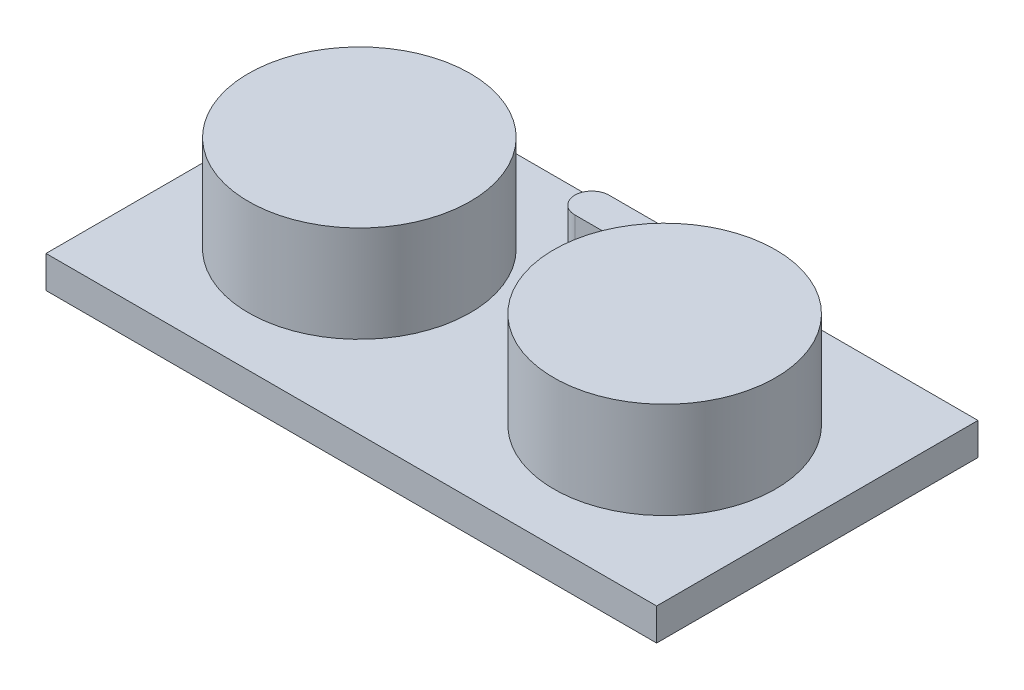
ISO-10303-21;
HEADER;
FILE_DESCRIPTION(('STEP AP214'),'2;1');
FILE_NAME('part.step','',(''),(''),'','','');
FILE_SCHEMA(('AUTOMOTIVE_DESIGN { 1 0 10303 214 1 1 1 1 }'));
ENDSEC;
DATA;
#1=APPLICATION_CONTEXT('core data for automotive mechanical design processes');
#2=APPLICATION_PROTOCOL_DEFINITION('international standard','automotive_design',2000,#1);
#3=PRODUCT_CONTEXT('',#1,'mechanical');
#4=PRODUCT('Part','Part','',(#3));
#5=PRODUCT_RELATED_PRODUCT_CATEGORY('part','',(#4));
#6=PRODUCT_DEFINITION_FORMATION('','',#4);
#7=PRODUCT_DEFINITION_CONTEXT('part definition',#1,'design');
#8=PRODUCT_DEFINITION('design','',#6,#7);
#9=PRODUCT_DEFINITION_SHAPE('','',#8);
#10=(LENGTH_UNIT() NAMED_UNIT(*) SI_UNIT(.MILLI.,.METRE.));
#11=(NAMED_UNIT(*) PLANE_ANGLE_UNIT() SI_UNIT($,.RADIAN.));
#12=(NAMED_UNIT(*) SI_UNIT($,.STERADIAN.) SOLID_ANGLE_UNIT());
#13=UNCERTAINTY_MEASURE_WITH_UNIT(LENGTH_MEASURE(1.E-05),#10,'distance_accuracy_value','');
#14=(GEOMETRIC_REPRESENTATION_CONTEXT(3) GLOBAL_UNCERTAINTY_ASSIGNED_CONTEXT((#13)) GLOBAL_UNIT_ASSIGNED_CONTEXT((#10,
#11,#12)) REPRESENTATION_CONTEXT('',''));
#15=CARTESIAN_POINT('',(0.,0.,0.));
#16=DIRECTION('',(0.,0.,1.));
#17=DIRECTION('',(1.,0.,0.));
#18=AXIS2_PLACEMENT_3D('',#15,#16,#17);
#19=CARTESIAN_POINT('',(-30.4443925233645,2.54,0.));
#20=DIRECTION('',(1.,0.,0.));
#21=DIRECTION('',(0.,0.,-1.));
#22=AXIS2_PLACEMENT_3D('',#19,#20,#21);
#23=PLANE('',#22);
#24=DIRECTION('',(0.,0.,1.));
#25=VECTOR('',#24,1.);
#26=CARTESIAN_POINT('',(-30.4443925233645,0.,0.));
#27=LINE('',#26,#25);
#28=CARTESIAN_POINT('',(-30.4443925233645,0.,-5.16011682242991));
#29=VERTEX_POINT('',#28);
#30=CARTESIAN_POINT('',(-30.4443925233645,0.,20.2398831775701));
#31=VERTEX_POINT('',#30);
#32=EDGE_CURVE('E176',#29,#31,#27,.T.);
#33=ORIENTED_EDGE('',*,*,#32,.T.);
#34=DIRECTION('',(0.,-1.,0.));
#35=VECTOR('',#34,1.);
#36=CARTESIAN_POINT('',(-30.4443925233645,2.54,20.2398831775701));
#37=LINE('',#36,#35);
#38=CARTESIAN_POINT('',(-30.4443925233645,2.54,20.2398831775701));
#39=VERTEX_POINT('',#38);
#40=EDGE_CURVE('E53',#39,#31,#37,.T.);
#41=ORIENTED_EDGE('',*,*,#40,.F.);
#42=DIRECTION('',(0.,0.,1.));
#43=VECTOR('',#42,1.);
#44=CARTESIAN_POINT('',(-30.4443925233645,2.54,0.));
#45=LINE('',#44,#43);
#46=CARTESIAN_POINT('',(-30.4443925233645,2.54,-5.16011682242991));
#47=VERTEX_POINT('',#46);
#48=EDGE_CURVE('E177',#47,#39,#45,.T.);
#49=ORIENTED_EDGE('',*,*,#48,.F.);
#50=DIRECTION('',(0.,-1.,0.));
#51=VECTOR('',#50,1.);
#52=CARTESIAN_POINT('',(-30.4443925233645,2.54,-5.16011682242991));
#53=LINE('',#52,#51);
#54=EDGE_CURVE('E69',#47,#29,#53,.T.);
#55=ORIENTED_EDGE('',*,*,#54,.T.);
#56=EDGE_LOOP('',(#33,#41,#49,#55));
#57=FACE_BOUND('',#56,.T.);
#58=ADVANCED_FACE('F45',(#57),#23,.F.);
#59=CARTESIAN_POINT('',(0.,2.54,20.2398831775701));
#60=DIRECTION('',(0.,0.,-1.));
#61=DIRECTION('',(-1.,0.,0.));
#62=AXIS2_PLACEMENT_3D('',#59,#60,#61);
#63=PLANE('',#62);
#64=DIRECTION('',(1.,0.,0.));
#65=VECTOR('',#64,1.);
#66=CARTESIAN_POINT('',(0.,0.,20.2398831775701));
#67=LINE('',#66,#65);
#68=CARTESIAN_POINT('',(17.8156074766355,0.,20.2398831775701));
#69=VERTEX_POINT('',#68);
#70=EDGE_CURVE('E192',#31,#69,#67,.T.);
#71=ORIENTED_EDGE('',*,*,#70,.T.);
#72=DIRECTION('',(0.,-1.,0.));
#73=VECTOR('',#72,1.);
#74=CARTESIAN_POINT('',(17.8156074766355,2.54,20.2398831775701));
#75=LINE('',#74,#73);
#76=CARTESIAN_POINT('',(17.8156074766355,2.54,20.2398831775701));
#77=VERTEX_POINT('',#76);
#78=EDGE_CURVE('E208',#77,#69,#75,.T.);
#79=ORIENTED_EDGE('',*,*,#78,.F.);
#80=DIRECTION('',(1.,0.,0.));
#81=VECTOR('',#80,1.);
#82=CARTESIAN_POINT('',(0.,2.54,20.2398831775701));
#83=LINE('',#82,#81);
#84=EDGE_CURVE('E96',#39,#77,#83,.T.);
#85=ORIENTED_EDGE('',*,*,#84,.F.);
#86=ORIENTED_EDGE('',*,*,#40,.T.);
#87=EDGE_LOOP('',(#71,#79,#85,#86));
#88=FACE_BOUND('',#87,.T.);
#89=ADVANCED_FACE('F212',(#88),#63,.F.);
#90=CARTESIAN_POINT('',(17.8156074766355,2.54,0.));
#91=DIRECTION('',(1.,0.,0.));
#92=DIRECTION('',(0.,0.,-1.));
#93=AXIS2_PLACEMENT_3D('',#90,#91,#92);
#94=PLANE('',#93);
#95=DIRECTION('',(0.,0.,1.));
#96=VECTOR('',#95,1.);
#97=CARTESIAN_POINT('',(17.8156074766355,0.,0.));
#98=LINE('',#97,#96);
#99=CARTESIAN_POINT('',(17.8156074766355,0.,-5.16011682242991));
#100=VERTEX_POINT('',#99);
#101=EDGE_CURVE('E196',#100,#69,#98,.T.);
#102=ORIENTED_EDGE('',*,*,#101,.F.);
#103=DIRECTION('',(0.,-1.,0.));
#104=VECTOR('',#103,1.);
#105=CARTESIAN_POINT('',(17.8156074766355,2.54,-5.16011682242991));
#106=LINE('',#105,#104);
#107=CARTESIAN_POINT('',(17.8156074766355,2.54,-5.16011682242991));
#108=VERTEX_POINT('',#107);
#109=EDGE_CURVE('E205',#108,#100,#106,.T.);
#110=ORIENTED_EDGE('',*,*,#109,.F.);
#111=DIRECTION('',(0.,0.,1.));
#112=VECTOR('',#111,1.);
#113=CARTESIAN_POINT('',(17.8156074766355,2.54,0.));
#114=LINE('',#113,#112);
#115=EDGE_CURVE('E183',#108,#77,#114,.T.);
#116=ORIENTED_EDGE('',*,*,#115,.T.);
#117=ORIENTED_EDGE('',*,*,#78,.T.);
#118=EDGE_LOOP('',(#102,#110,#116,#117));
#119=FACE_BOUND('',#118,.T.);
#120=ADVANCED_FACE('F220',(#119),#94,.T.);
#121=CARTESIAN_POINT('',(0.,2.54,-5.16011682242991));
#122=DIRECTION('',(0.,0.,-1.));
#123=DIRECTION('',(-1.,0.,0.));
#124=AXIS2_PLACEMENT_3D('',#121,#122,#123);
#125=PLANE('',#124);
#126=DIRECTION('',(1.,0.,0.));
#127=VECTOR('',#126,1.);
#128=CARTESIAN_POINT('',(0.,0.,-5.16011682242991));
#129=LINE('',#128,#127);
#130=EDGE_CURVE('E180',#29,#100,#129,.T.);
#131=ORIENTED_EDGE('',*,*,#130,.F.);
#132=ORIENTED_EDGE('',*,*,#54,.F.);
#133=DIRECTION('',(1.,0.,0.));
#134=VECTOR('',#133,1.);
#135=CARTESIAN_POINT('',(0.,2.54,-5.16011682242991));
#136=LINE('',#135,#134);
#137=EDGE_CURVE('E187',#47,#108,#136,.T.);
#138=ORIENTED_EDGE('',*,*,#137,.T.);
#139=ORIENTED_EDGE('',*,*,#109,.T.);
#140=EDGE_LOOP('',(#131,#132,#138,#139));
#141=FACE_BOUND('',#140,.T.);
#142=ADVANCED_FACE('F215',(#141),#125,.T.);
#143=CARTESIAN_POINT('',(0.,2.54,0.));
#144=DIRECTION('',(0.,1.,0.));
#145=DIRECTION('',(0.,0.,1.));
#146=AXIS2_PLACEMENT_3D('',#143,#144,#145);
#147=PLANE('',#146);
#148=CARTESIAN_POINT('',(-9.64277486318207,2.54,-2.10722501049491));
#149=DIRECTION('',(0.,1.,0.));
#150=DIRECTION('',(0.,0.,1.));
#151=AXIS2_PLACEMENT_3D('',#148,#149,#150);
#152=CIRCLE('',#151,1.35215532555089);
#153=CARTESIAN_POINT('',(-9.64277486318207,2.54,-0.755069684944015));
#154=VERTEX_POINT('',#153);
#155=CARTESIAN_POINT('',(-9.64277486318207,2.54,-3.4593803360458));
#156=VERTEX_POINT('',#155);
#157=EDGE_CURVE('E159',#154,#156,#152,.F.);
#158=ORIENTED_EDGE('',*,*,#157,.T.);
#159=DIRECTION('',(1.,0.,0.));
#160=VECTOR('',#159,1.);
#161=CARTESIAN_POINT('',(0.,2.54,-3.4593803360458));
#162=LINE('',#161,#160);
#163=CARTESIAN_POINT('',(-2.56996239106971,2.54,-3.4593803360458));
#164=VERTEX_POINT('',#163);
#165=EDGE_CURVE('E144',#156,#164,#162,.T.);
#166=ORIENTED_EDGE('',*,*,#165,.T.);
#167=CARTESIAN_POINT('',(-2.56996239106971,2.54,-2.10722501049491));
#168=DIRECTION('',(0.,1.,0.));
#169=DIRECTION('',(0.,0.,1.));
#170=AXIS2_PLACEMENT_3D('',#167,#168,#169);
#171=CIRCLE('',#170,1.35215532555089);
#172=CARTESIAN_POINT('',(-2.56996239106971,2.54,-0.755069684944015));
#173=VERTEX_POINT('',#172);
#174=EDGE_CURVE('E146',#164,#173,#171,.F.);
#175=ORIENTED_EDGE('',*,*,#174,.T.);
#176=DIRECTION('',(-1.,0.,0.));
#177=VECTOR('',#176,1.);
#178=CARTESIAN_POINT('',(0.,2.54,-0.755069684944015));
#179=LINE('',#178,#177);
#180=EDGE_CURVE('E151',#173,#154,#179,.T.);
#181=ORIENTED_EDGE('',*,*,#180,.T.);
#182=EDGE_LOOP('',(#158,#166,#175,#181));
#183=FACE_BOUND('',#182,.T.);
#184=CARTESIAN_POINT('',(5.7506074766355,2.54,7.53988317757009));
#185=DIRECTION('',(0.,1.,0.));
#186=DIRECTION('',(0.,0.,1.));
#187=AXIS2_PLACEMENT_3D('',#184,#185,#186);
#188=CIRCLE('',#187,8.76516143286362);
#189=CARTESIAN_POINT('',(5.7506074766355,2.54,-1.22527825529352));
#190=VERTEX_POINT('',#189);
#191=EDGE_CURVE('E165',#190,#190,#188,.T.);
#192=ORIENTED_EDGE('',*,*,#191,.F.);
#193=EDGE_LOOP('',(#192));
#194=FACE_BOUND('',#193,.T.);
#195=CARTESIAN_POINT('',(-18.3793925233645,2.54,7.53988317757009));
#196=DIRECTION('',(0.,1.,0.));
#197=DIRECTION('',(0.,0.,1.));
#198=AXIS2_PLACEMENT_3D('',#195,#196,#197);
#199=CIRCLE('',#198,8.76516143286362);
#200=CARTESIAN_POINT('',(-18.3793925233645,2.54,-1.22527825529352));
#201=VERTEX_POINT('',#200);
#202=EDGE_CURVE('E11',#201,#201,#199,.T.);
#203=ORIENTED_EDGE('',*,*,#202,.F.);
#204=EDGE_LOOP('',(#203));
#205=FACE_BOUND('',#204,.T.);
#206=ORIENTED_EDGE('',*,*,#48,.T.);
#207=ORIENTED_EDGE('',*,*,#84,.T.);
#208=ORIENTED_EDGE('',*,*,#115,.F.);
#209=ORIENTED_EDGE('',*,*,#137,.F.);
#210=EDGE_LOOP('',(#206,#207,#208,#209));
#211=FACE_BOUND('',#210,.T.);
#212=ADVANCED_FACE('F222',(#183,#194,#205,#211),#147,.T.);
#213=CARTESIAN_POINT('',(0.,0.,0.));
#214=DIRECTION('',(0.,1.,0.));
#215=DIRECTION('',(0.,0.,1.));
#216=AXIS2_PLACEMENT_3D('',#213,#214,#215);
#217=PLANE('',#216);
#218=ORIENTED_EDGE('',*,*,#32,.F.);
#219=ORIENTED_EDGE('',*,*,#130,.T.);
#220=ORIENTED_EDGE('',*,*,#101,.T.);
#221=ORIENTED_EDGE('',*,*,#70,.F.);
#222=EDGE_LOOP('',(#218,#219,#220,#221));
#223=FACE_BOUND('',#222,.T.);
#224=ADVANCED_FACE('F214',(#223),#217,.F.);
#225=CARTESIAN_POINT('',(-18.3793925233645,10.16,7.53988317757009));
#226=DIRECTION('',(0.,-1.,0.));
#227=DIRECTION('',(0.,0.,-1.));
#228=AXIS2_PLACEMENT_3D('',#225,#226,#227);
#229=CYLINDRICAL_SURFACE('',#228,8.76516143286362);
#230=CARTESIAN_POINT('',(-18.3793925233645,10.16,7.53988317757009));
#231=DIRECTION('',(0.,-1.,0.));
#232=DIRECTION('',(0.,0.,-1.));
#233=AXIS2_PLACEMENT_3D('',#230,#231,#232);
#234=CIRCLE('',#233,8.76516143286362);
#235=CARTESIAN_POINT('',(-18.3793925233645,10.16,-1.22527825529352));
#236=VERTEX_POINT('',#235);
#237=EDGE_CURVE('E169',#236,#236,#234,.T.);
#238=CARTESIAN_POINT('',(-18.3793925233645,10.16,-1.22527825529352));
#239=CARTESIAN_POINT('',(-18.3793925233645,10.080625,-1.22527825529352));
#240=CARTESIAN_POINT('',(-18.3793925233645,10.00125,-1.22527825529352));
#241=CARTESIAN_POINT('',(-18.3793925233645,9.8425,-1.22527825529352));
#242=CARTESIAN_POINT('',(-18.3793925233645,9.763125,-1.22527825529352));
#243=CARTESIAN_POINT('',(-18.3793925233645,9.604375,-1.22527825529352));
#244=CARTESIAN_POINT('',(-18.3793925233645,9.525,-1.22527825529352));
#245=CARTESIAN_POINT('',(-18.3793925233645,9.36625,-1.22527825529352));
#246=CARTESIAN_POINT('',(-18.3793925233645,9.286875,-1.22527825529352));
#247=CARTESIAN_POINT('',(-18.3793925233645,9.128125,-1.22527825529352));
#248=CARTESIAN_POINT('',(-18.3793925233645,9.04875,-1.22527825529352));
#249=CARTESIAN_POINT('',(-18.3793925233645,8.89,-1.22527825529352));
#250=CARTESIAN_POINT('',(-18.3793925233645,8.810625,-1.22527825529352));
#251=CARTESIAN_POINT('',(-18.3793925233645,8.651875,-1.22527825529352));
#252=CARTESIAN_POINT('',(-18.3793925233645,8.5725,-1.22527825529352));
#253=CARTESIAN_POINT('',(-18.3793925233645,8.41375,-1.22527825529352));
#254=CARTESIAN_POINT('',(-18.3793925233645,8.334375,-1.22527825529352));
#255=CARTESIAN_POINT('',(-18.3793925233645,8.175625,-1.22527825529352));
#256=CARTESIAN_POINT('',(-18.3793925233645,8.09625,-1.22527825529352));
#257=CARTESIAN_POINT('',(-18.3793925233645,7.9375,-1.22527825529352));
#258=CARTESIAN_POINT('',(-18.3793925233645,7.858125,-1.22527825529352));
#259=CARTESIAN_POINT('',(-18.3793925233645,7.699375,-1.22527825529352));
#260=CARTESIAN_POINT('',(-18.3793925233645,7.62,-1.22527825529352));
#261=CARTESIAN_POINT('',(-18.3793925233645,7.46125,-1.22527825529352));
#262=CARTESIAN_POINT('',(-18.3793925233645,7.381875,-1.22527825529352));
#263=CARTESIAN_POINT('',(-18.3793925233645,7.223125,-1.22527825529352));
#264=CARTESIAN_POINT('',(-18.3793925233645,7.14375,-1.22527825529352));
#265=CARTESIAN_POINT('',(-18.3793925233645,6.985,-1.22527825529352));
#266=CARTESIAN_POINT('',(-18.3793925233645,6.905625,-1.22527825529352));
#267=CARTESIAN_POINT('',(-18.3793925233645,6.746875,-1.22527825529352));
#268=CARTESIAN_POINT('',(-18.3793925233645,6.6675,-1.22527825529352));
#269=CARTESIAN_POINT('',(-18.3793925233645,6.50875,-1.22527825529352));
#270=CARTESIAN_POINT('',(-18.3793925233645,6.429375,-1.22527825529352));
#271=CARTESIAN_POINT('',(-18.3793925233645,6.270625,-1.22527825529352));
#272=CARTESIAN_POINT('',(-18.3793925233645,6.19125,-1.22527825529352));
#273=CARTESIAN_POINT('',(-18.3793925233645,6.0325,-1.22527825529352));
#274=CARTESIAN_POINT('',(-18.3793925233645,5.953125,-1.22527825529352));
#275=CARTESIAN_POINT('',(-18.3793925233645,5.794375,-1.22527825529352));
#276=CARTESIAN_POINT('',(-18.3793925233645,5.715,-1.22527825529352));
#277=CARTESIAN_POINT('',(-18.3793925233645,5.55625,-1.22527825529352));
#278=CARTESIAN_POINT('',(-18.3793925233645,5.476875,-1.22527825529352));
#279=CARTESIAN_POINT('',(-18.3793925233645,5.318125,-1.22527825529352));
#280=CARTESIAN_POINT('',(-18.3793925233645,5.23875,-1.22527825529352));
#281=CARTESIAN_POINT('',(-18.3793925233645,5.08,-1.22527825529352));
#282=CARTESIAN_POINT('',(-18.3793925233645,5.000625,-1.22527825529352));
#283=CARTESIAN_POINT('',(-18.3793925233645,4.841875,-1.22527825529352));
#284=CARTESIAN_POINT('',(-18.3793925233645,4.7625,-1.22527825529352));
#285=CARTESIAN_POINT('',(-18.3793925233645,4.60375,-1.22527825529352));
#286=CARTESIAN_POINT('',(-18.3793925233645,4.524375,-1.22527825529352));
#287=CARTESIAN_POINT('',(-18.3793925233645,4.365625,-1.22527825529352));
#288=CARTESIAN_POINT('',(-18.3793925233645,4.28625,-1.22527825529352));
#289=CARTESIAN_POINT('',(-18.3793925233645,4.1275,-1.22527825529352));
#290=CARTESIAN_POINT('',(-18.3793925233645,4.048125,-1.22527825529352));
#291=CARTESIAN_POINT('',(-18.3793925233645,3.889375,-1.22527825529352));
#292=CARTESIAN_POINT('',(-18.3793925233645,3.81,-1.22527825529352));
#293=CARTESIAN_POINT('',(-18.3793925233645,3.65125,-1.22527825529352));
#294=CARTESIAN_POINT('',(-18.3793925233645,3.571875,-1.22527825529352));
#295=CARTESIAN_POINT('',(-18.3793925233645,3.413125,-1.22527825529352));
#296=CARTESIAN_POINT('',(-18.3793925233645,3.33375,-1.22527825529352));
#297=CARTESIAN_POINT('',(-18.3793925233645,3.175,-1.22527825529352));
#298=CARTESIAN_POINT('',(-18.3793925233645,3.095625,-1.22527825529352));
#299=CARTESIAN_POINT('',(-18.3793925233645,2.936875,-1.22527825529352));
#300=CARTESIAN_POINT('',(-18.3793925233645,2.8575,-1.22527825529352));
#301=CARTESIAN_POINT('',(-18.3793925233645,2.69875,-1.22527825529352));
#302=CARTESIAN_POINT('',(-18.3793925233645,2.619375,-1.22527825529352));
#303=CARTESIAN_POINT('',(-18.3793925233645,2.54,-1.22527825529352));
#304=B_SPLINE_CURVE_WITH_KNOTS('',3,(#238,#239,#240,#241,#242,#243,#244,#245,#246,#247,#248,
#249,#250,#251,#252,#253,#254,#255,#256,#257,#258,#259,#260,#261,#262,#263,#264,#265,#266,#267,
#268,#269,#270,#271,#272,#273,#274,#275,#276,#277,#278,#279,#280,#281,#282,#283,#284,#285,#286,
#287,#288,#289,#290,#291,#292,#293,#294,#295,#296,#297,#298,#299,#300,#301,#302,#303),
.UNSPECIFIED.,.F.,.F.,(4,2,2,2,2,2,2,2,2,2,2,2,2,2,2,2,2,2,2,2,2,2,2,2,2,2,2,2,2,2,2,2,4),(0.,
0.238125,0.476250000000001,0.714375000000001,0.9525,1.190625,1.42875,1.666875,1.905,2.143125,
2.38125,2.619375,2.8575,3.095625,3.33375,3.571875,3.81,4.048125,4.28625,4.524375,4.7625,
5.000625,5.23875,5.476875,5.715,5.953125,6.19125,6.429375,6.6675,6.905625,7.14375,7.381875,
7.62),.UNSPECIFIED.);
#305=EDGE_CURVE('BSEAM230',#236,#201,#304,.T.);
#306=ORIENTED_EDGE('',*,*,#237,.T.);
#307=ORIENTED_EDGE('',*,*,#202,.T.);
#308=ORIENTED_EDGE('',*,*,#305,.T.);
#309=ORIENTED_EDGE('',*,*,#305,.F.);
#310=EDGE_LOOP('',(#306,#308,#307,#309));
#311=FACE_BOUND('',#310,.T.);
#312=ADVANCED_FACE('F230',(#311),#229,.T.);
#313=CARTESIAN_POINT('',(-18.3793925233645,10.16,7.53988317757009));
#314=DIRECTION('',(0.,-1.,0.));
#315=DIRECTION('',(0.,0.,-1.));
#316=AXIS2_PLACEMENT_3D('',#313,#314,#315);
#317=PLANE('',#316);
#318=ORIENTED_EDGE('',*,*,#237,.F.);
#319=EDGE_LOOP('',(#318));
#320=FACE_BOUND('',#319,.T.);
#321=ADVANCED_FACE('F265',(#320),#317,.F.);
#322=CARTESIAN_POINT('',(5.7506074766355,10.16,7.53988317757009));
#323=DIRECTION('',(0.,-1.,0.));
#324=DIRECTION('',(0.,0.,-1.));
#325=AXIS2_PLACEMENT_3D('',#322,#323,#324);
#326=CYLINDRICAL_SURFACE('',#325,8.76516143286362);
#327=CARTESIAN_POINT('',(5.7506074766355,10.16,7.53988317757009));
#328=DIRECTION('',(0.,1.,0.));
#329=DIRECTION('',(0.,0.,1.));
#330=AXIS2_PLACEMENT_3D('',#327,#328,#329);
#331=CIRCLE('',#330,8.76516143286362);
#332=CARTESIAN_POINT('',(5.7506074766355,10.16,-1.22527825529352));
#333=VERTEX_POINT('',#332);
#334=EDGE_CURVE('E164',#333,#333,#331,.T.);
#335=CARTESIAN_POINT('',(5.7506074766355,10.16,-1.22527825529352));
#336=CARTESIAN_POINT('',(5.7506074766355,10.080625,-1.22527825529352));
#337=CARTESIAN_POINT('',(5.7506074766355,10.00125,-1.22527825529352));
#338=CARTESIAN_POINT('',(5.7506074766355,9.8425,-1.22527825529352));
#339=CARTESIAN_POINT('',(5.7506074766355,9.763125,-1.22527825529352));
#340=CARTESIAN_POINT('',(5.7506074766355,9.604375,-1.22527825529352));
#341=CARTESIAN_POINT('',(5.7506074766355,9.525,-1.22527825529352));
#342=CARTESIAN_POINT('',(5.7506074766355,9.36625,-1.22527825529352));
#343=CARTESIAN_POINT('',(5.7506074766355,9.286875,-1.22527825529352));
#344=CARTESIAN_POINT('',(5.7506074766355,9.128125,-1.22527825529352));
#345=CARTESIAN_POINT('',(5.7506074766355,9.04875,-1.22527825529352));
#346=CARTESIAN_POINT('',(5.7506074766355,8.89,-1.22527825529352));
#347=CARTESIAN_POINT('',(5.7506074766355,8.810625,-1.22527825529352));
#348=CARTESIAN_POINT('',(5.7506074766355,8.651875,-1.22527825529352));
#349=CARTESIAN_POINT('',(5.7506074766355,8.5725,-1.22527825529352));
#350=CARTESIAN_POINT('',(5.7506074766355,8.41375,-1.22527825529352));
#351=CARTESIAN_POINT('',(5.7506074766355,8.334375,-1.22527825529352));
#352=CARTESIAN_POINT('',(5.7506074766355,8.175625,-1.22527825529352));
#353=CARTESIAN_POINT('',(5.7506074766355,8.09625,-1.22527825529352));
#354=CARTESIAN_POINT('',(5.7506074766355,7.9375,-1.22527825529352));
#355=CARTESIAN_POINT('',(5.7506074766355,7.858125,-1.22527825529352));
#356=CARTESIAN_POINT('',(5.7506074766355,7.699375,-1.22527825529352));
#357=CARTESIAN_POINT('',(5.7506074766355,7.62,-1.22527825529352));
#358=CARTESIAN_POINT('',(5.7506074766355,7.46125,-1.22527825529352));
#359=CARTESIAN_POINT('',(5.7506074766355,7.381875,-1.22527825529352));
#360=CARTESIAN_POINT('',(5.7506074766355,7.223125,-1.22527825529352));
#361=CARTESIAN_POINT('',(5.7506074766355,7.14375,-1.22527825529352));
#362=CARTESIAN_POINT('',(5.7506074766355,6.985,-1.22527825529352));
#363=CARTESIAN_POINT('',(5.7506074766355,6.905625,-1.22527825529352));
#364=CARTESIAN_POINT('',(5.7506074766355,6.746875,-1.22527825529352));
#365=CARTESIAN_POINT('',(5.7506074766355,6.6675,-1.22527825529352));
#366=CARTESIAN_POINT('',(5.7506074766355,6.50875,-1.22527825529352));
#367=CARTESIAN_POINT('',(5.7506074766355,6.429375,-1.22527825529352));
#368=CARTESIAN_POINT('',(5.7506074766355,6.270625,-1.22527825529352));
#369=CARTESIAN_POINT('',(5.7506074766355,6.19125,-1.22527825529352));
#370=CARTESIAN_POINT('',(5.7506074766355,6.0325,-1.22527825529352));
#371=CARTESIAN_POINT('',(5.7506074766355,5.953125,-1.22527825529352));
#372=CARTESIAN_POINT('',(5.7506074766355,5.794375,-1.22527825529352));
#373=CARTESIAN_POINT('',(5.7506074766355,5.715,-1.22527825529352));
#374=CARTESIAN_POINT('',(5.7506074766355,5.55625,-1.22527825529352));
#375=CARTESIAN_POINT('',(5.7506074766355,5.476875,-1.22527825529352));
#376=CARTESIAN_POINT('',(5.7506074766355,5.318125,-1.22527825529352));
#377=CARTESIAN_POINT('',(5.7506074766355,5.23875,-1.22527825529352));
#378=CARTESIAN_POINT('',(5.7506074766355,5.08,-1.22527825529352));
#379=CARTESIAN_POINT('',(5.7506074766355,5.000625,-1.22527825529352));
#380=CARTESIAN_POINT('',(5.7506074766355,4.841875,-1.22527825529352));
#381=CARTESIAN_POINT('',(5.7506074766355,4.7625,-1.22527825529352));
#382=CARTESIAN_POINT('',(5.7506074766355,4.60375,-1.22527825529352));
#383=CARTESIAN_POINT('',(5.7506074766355,4.524375,-1.22527825529352));
#384=CARTESIAN_POINT('',(5.7506074766355,4.365625,-1.22527825529352));
#385=CARTESIAN_POINT('',(5.7506074766355,4.28625,-1.22527825529352));
#386=CARTESIAN_POINT('',(5.7506074766355,4.1275,-1.22527825529352));
#387=CARTESIAN_POINT('',(5.7506074766355,4.048125,-1.22527825529352));
#388=CARTESIAN_POINT('',(5.7506074766355,3.889375,-1.22527825529352));
#389=CARTESIAN_POINT('',(5.7506074766355,3.81,-1.22527825529352));
#390=CARTESIAN_POINT('',(5.7506074766355,3.65125,-1.22527825529352));
#391=CARTESIAN_POINT('',(5.7506074766355,3.571875,-1.22527825529352));
#392=CARTESIAN_POINT('',(5.7506074766355,3.413125,-1.22527825529352));
#393=CARTESIAN_POINT('',(5.7506074766355,3.33375,-1.22527825529352));
#394=CARTESIAN_POINT('',(5.7506074766355,3.175,-1.22527825529352));
#395=CARTESIAN_POINT('',(5.7506074766355,3.095625,-1.22527825529352));
#396=CARTESIAN_POINT('',(5.7506074766355,2.936875,-1.22527825529352));
#397=CARTESIAN_POINT('',(5.7506074766355,2.8575,-1.22527825529352));
#398=CARTESIAN_POINT('',(5.7506074766355,2.69875,-1.22527825529352));
#399=CARTESIAN_POINT('',(5.7506074766355,2.619375,-1.22527825529352));
#400=CARTESIAN_POINT('',(5.7506074766355,2.54,-1.22527825529352));
#401=B_SPLINE_CURVE_WITH_KNOTS('',3,(#335,#336,#337,#338,#339,#340,#341,#342,#343,#344,#345,
#346,#347,#348,#349,#350,#351,#352,#353,#354,#355,#356,#357,#358,#359,#360,#361,#362,#363,#364,
#365,#366,#367,#368,#369,#370,#371,#372,#373,#374,#375,#376,#377,#378,#379,#380,#381,#382,#383,
#384,#385,#386,#387,#388,#389,#390,#391,#392,#393,#394,#395,#396,#397,#398,#399,#400),
.UNSPECIFIED.,.F.,.F.,(4,2,2,2,2,2,2,2,2,2,2,2,2,2,2,2,2,2,2,2,2,2,2,2,2,2,2,2,2,2,2,2,4),(0.,
0.238124999999999,0.476249999999999,0.714375,0.952499999999998,1.190625,1.42875,1.666875,1.905,
2.143125,2.38125,2.619375,2.8575,3.095625,3.33375,3.571875,3.81,4.048125,4.28625,4.524375,
4.7625,5.000625,5.23875,5.476875,5.715,5.953125,6.19125,6.429375,6.6675,6.905625,7.14375,
7.381875,7.62),.UNSPECIFIED.);
#402=EDGE_CURVE('BSEAM272',#333,#190,#401,.T.);
#403=ORIENTED_EDGE('',*,*,#334,.F.);
#404=ORIENTED_EDGE('',*,*,#191,.T.);
#405=ORIENTED_EDGE('',*,*,#402,.T.);
#406=ORIENTED_EDGE('',*,*,#402,.F.);
#407=EDGE_LOOP('',(#403,#405,#404,#406));
#408=FACE_BOUND('',#407,.T.);
#409=ADVANCED_FACE('F272',(#408),#326,.T.);
#410=CARTESIAN_POINT('',(5.7506074766355,10.16,7.53988317757009));
#411=DIRECTION('',(0.,1.,0.));
#412=DIRECTION('',(0.,0.,1.));
#413=AXIS2_PLACEMENT_3D('',#410,#411,#412);
#414=PLANE('',#413);
#415=ORIENTED_EDGE('',*,*,#334,.T.);
#416=EDGE_LOOP('',(#415));
#417=FACE_BOUND('',#416,.T.);
#418=ADVANCED_FACE('F280',(#417),#414,.T.);
#419=CARTESIAN_POINT('',(0.,5.08,-3.4593803360458));
#420=DIRECTION('',(0.,0.,1.));
#421=DIRECTION('',(1.,0.,0.));
#422=AXIS2_PLACEMENT_3D('',#419,#420,#421);
#423=PLANE('',#422);
#424=ORIENTED_EDGE('',*,*,#165,.F.);
#425=DIRECTION('',(0.,-1.,0.));
#426=VECTOR('',#425,1.);
#427=CARTESIAN_POINT('',(-9.64277486318207,5.08,-3.4593803360458));
#428=LINE('',#427,#426);
#429=CARTESIAN_POINT('',(-9.64277486318207,5.08,-3.4593803360458));
#430=VERTEX_POINT('',#429);
#431=EDGE_CURVE('E124',#430,#156,#428,.T.);
#432=ORIENTED_EDGE('',*,*,#431,.F.);
#433=DIRECTION('',(-1.,0.,0.));
#434=VECTOR('',#433,1.);
#435=CARTESIAN_POINT('',(0.,5.08,-3.4593803360458));
#436=LINE('',#435,#434);
#437=CARTESIAN_POINT('',(-2.56996239106971,5.08,-3.4593803360458));
#438=VERTEX_POINT('',#437);
#439=EDGE_CURVE('E132',#438,#430,#436,.T.);
#440=ORIENTED_EDGE('',*,*,#439,.F.);
#441=DIRECTION('',(0.,-1.,0.));
#442=VECTOR('',#441,1.);
#443=CARTESIAN_POINT('',(-2.56996239106971,5.08,-3.4593803360458));
#444=LINE('',#443,#442);
#445=EDGE_CURVE('E366',#438,#164,#444,.T.);
#446=ORIENTED_EDGE('',*,*,#445,.T.);
#447=EDGE_LOOP('',(#424,#432,#440,#446));
#448=FACE_BOUND('',#447,.T.);
#449=ADVANCED_FACE('F142',(#448),#423,.F.);
#450=CARTESIAN_POINT('',(-9.64277486318207,5.08,-2.10722501049491));
#451=DIRECTION('',(0.,-1.,0.));
#452=DIRECTION('',(0.,0.,-1.));
#453=AXIS2_PLACEMENT_3D('',#450,#451,#452);
#454=CYLINDRICAL_SURFACE('',#453,1.35215532555089);
#455=ORIENTED_EDGE('',*,*,#157,.F.);
#456=DIRECTION('',(0.,-1.,0.));
#457=VECTOR('',#456,1.);
#458=CARTESIAN_POINT('',(-9.64277486318207,5.08,-0.755069684944015));
#459=LINE('',#458,#457);
#460=CARTESIAN_POINT('',(-9.64277486318207,5.08,-0.755069684944015));
#461=VERTEX_POINT('',#460);
#462=EDGE_CURVE('E127',#461,#154,#459,.T.);
#463=ORIENTED_EDGE('',*,*,#462,.F.);
#464=CARTESIAN_POINT('',(-9.64277486318207,5.08,-2.10722501049491));
#465=DIRECTION('',(0.,1.,0.));
#466=DIRECTION('',(0.,0.,1.));
#467=AXIS2_PLACEMENT_3D('',#464,#465,#466);
#468=CIRCLE('',#467,1.35215532555089);
#469=EDGE_CURVE('E120',#430,#461,#468,.T.);
#470=ORIENTED_EDGE('',*,*,#469,.F.);
#471=ORIENTED_EDGE('',*,*,#431,.T.);
#472=EDGE_LOOP('',(#455,#463,#470,#471));
#473=FACE_BOUND('',#472,.T.);
#474=ADVANCED_FACE('F122',(#473),#454,.T.);
#475=CARTESIAN_POINT('',(0.,5.08,-0.755069684944015));
#476=DIRECTION('',(0.,0.,-1.));
#477=DIRECTION('',(-1.,0.,0.));
#478=AXIS2_PLACEMENT_3D('',#475,#476,#477);
#479=PLANE('',#478);
#480=ORIENTED_EDGE('',*,*,#180,.F.);
#481=DIRECTION('',(0.,-1.,0.));
#482=VECTOR('',#481,1.);
#483=CARTESIAN_POINT('',(-2.56996239106971,5.08,-0.755069684944015));
#484=LINE('',#483,#482);
#485=CARTESIAN_POINT('',(-2.56996239106971,5.08,-0.755069684944015));
#486=VERTEX_POINT('',#485);
#487=EDGE_CURVE('E60',#486,#173,#484,.T.);
#488=ORIENTED_EDGE('',*,*,#487,.F.);
#489=DIRECTION('',(1.,0.,0.));
#490=VECTOR('',#489,1.);
#491=CARTESIAN_POINT('',(0.,5.08,-0.755069684944015));
#492=LINE('',#491,#490);
#493=EDGE_CURVE('E131',#461,#486,#492,.T.);
#494=ORIENTED_EDGE('',*,*,#493,.F.);
#495=ORIENTED_EDGE('',*,*,#462,.T.);
#496=EDGE_LOOP('',(#480,#488,#494,#495));
#497=FACE_BOUND('',#496,.T.);
#498=ADVANCED_FACE('F299',(#497),#479,.F.);
#499=CARTESIAN_POINT('',(-2.56996239106971,5.08,-2.10722501049491));
#500=DIRECTION('',(0.,-1.,0.));
#501=DIRECTION('',(0.,0.,-1.));
#502=AXIS2_PLACEMENT_3D('',#499,#500,#501);
#503=CYLINDRICAL_SURFACE('',#502,1.35215532555089);
#504=ORIENTED_EDGE('',*,*,#174,.F.);
#505=ORIENTED_EDGE('',*,*,#445,.F.);
#506=CARTESIAN_POINT('',(-2.56996239106971,5.08,-2.10722501049491));
#507=DIRECTION('',(0.,1.,0.));
#508=DIRECTION('',(0.,0.,1.));
#509=AXIS2_PLACEMENT_3D('',#506,#507,#508);
#510=CIRCLE('',#509,1.35215532555089);
#511=EDGE_CURVE('E136',#486,#438,#510,.T.);
#512=ORIENTED_EDGE('',*,*,#511,.F.);
#513=ORIENTED_EDGE('',*,*,#487,.T.);
#514=EDGE_LOOP('',(#504,#505,#512,#513));
#515=FACE_BOUND('',#514,.T.);
#516=ADVANCED_FACE('F306',(#515),#503,.T.);
#517=CARTESIAN_POINT('',(-9.64277486318207,5.08,-2.10722501049491));
#518=DIRECTION('',(0.,1.,0.));
#519=DIRECTION('',(0.,0.,1.));
#520=AXIS2_PLACEMENT_3D('',#517,#518,#519);
#521=PLANE('',#520);
#522=ORIENTED_EDGE('',*,*,#439,.T.);
#523=ORIENTED_EDGE('',*,*,#469,.T.);
#524=ORIENTED_EDGE('',*,*,#493,.T.);
#525=ORIENTED_EDGE('',*,*,#511,.T.);
#526=EDGE_LOOP('',(#522,#523,#524,#525));
#527=FACE_BOUND('',#526,.T.);
#528=ADVANCED_FACE('F135',(#527),#521,.T.);
#529=CLOSED_SHELL('',(#58,#89,#120,#142,#212,#224,#312,#321,#409,#418,#449,#474,#498,#516,#528));
#530=MANIFOLD_SOLID_BREP('B2',#529);
#531=ADVANCED_BREP_SHAPE_REPRESENTATION('',(#18,#530),#14);
#532=SHAPE_DEFINITION_REPRESENTATION(#9,#531);
ENDSEC;
END-ISO-10303-21;
